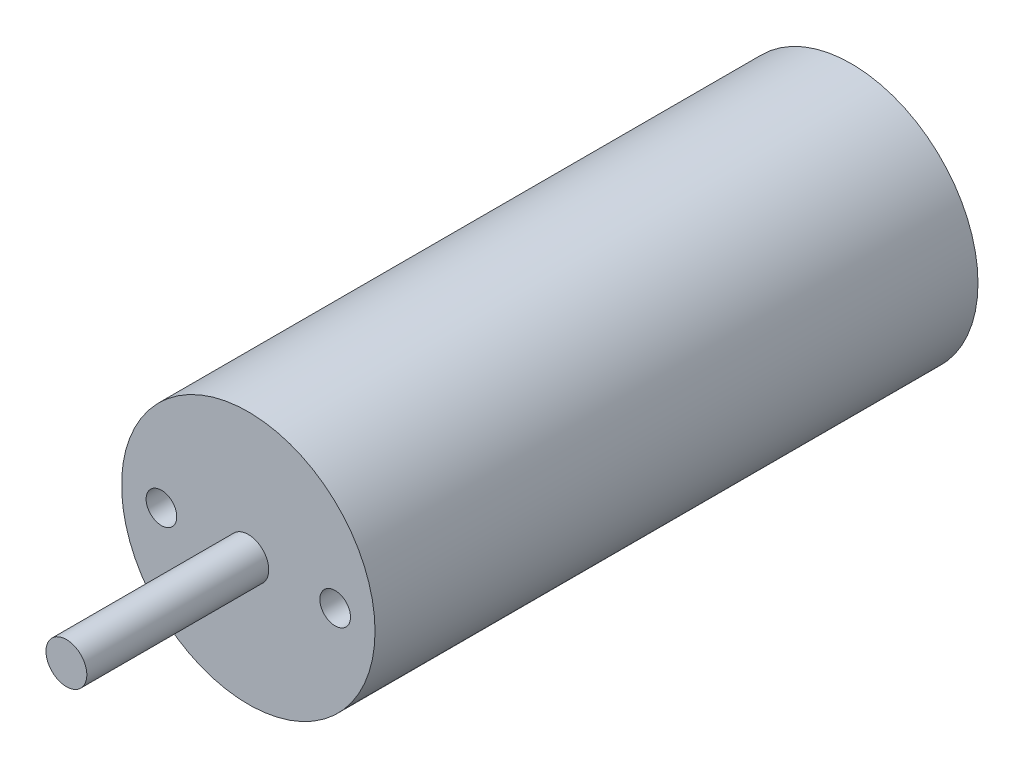
ISO-10303-21;
HEADER;
FILE_DESCRIPTION(('STEP AP214'),'2;1');
FILE_NAME('part.step','',(''),(''),'','','');
FILE_SCHEMA(('AUTOMOTIVE_DESIGN { 1 0 10303 214 1 1 1 1 }'));
ENDSEC;
DATA;
#1=APPLICATION_CONTEXT('core data for automotive mechanical design processes');
#2=APPLICATION_PROTOCOL_DEFINITION('international standard','automotive_design',2000,#1);
#3=PRODUCT_CONTEXT('',#1,'mechanical');
#4=PRODUCT('Part','Part','',(#3));
#5=PRODUCT_RELATED_PRODUCT_CATEGORY('part','',(#4));
#6=PRODUCT_DEFINITION_FORMATION('','',#4);
#7=PRODUCT_DEFINITION_CONTEXT('part definition',#1,'design');
#8=PRODUCT_DEFINITION('design','',#6,#7);
#9=PRODUCT_DEFINITION_SHAPE('','',#8);
#10=(LENGTH_UNIT() NAMED_UNIT(*) SI_UNIT(.MILLI.,.METRE.));
#11=(NAMED_UNIT(*) PLANE_ANGLE_UNIT() SI_UNIT($,.RADIAN.));
#12=(NAMED_UNIT(*) SI_UNIT($,.STERADIAN.) SOLID_ANGLE_UNIT());
#13=UNCERTAINTY_MEASURE_WITH_UNIT(LENGTH_MEASURE(1.E-05),#10,'distance_accuracy_value','');
#14=(GEOMETRIC_REPRESENTATION_CONTEXT(3) GLOBAL_UNCERTAINTY_ASSIGNED_CONTEXT((#13)) GLOBAL_UNIT_ASSIGNED_CONTEXT((#10,
#11,#12)) REPRESENTATION_CONTEXT('',''));
#15=CARTESIAN_POINT('',(0.,0.,0.));
#16=DIRECTION('',(0.,0.,1.));
#17=DIRECTION('',(1.,0.,0.));
#18=AXIS2_PLACEMENT_3D('',#15,#16,#17);
#19=CARTESIAN_POINT('',(12.4,0.,59.));
#20=DIRECTION('',(0.,0.,-1.));
#21=DIRECTION('',(-1.,0.,0.));
#22=AXIS2_PLACEMENT_3D('',#19,#20,#21);
#23=CYLINDRICAL_SURFACE('',#22,12.4);
#24=CARTESIAN_POINT('',(12.4,0.,59.));
#25=DIRECTION('',(0.,0.,1.));
#26=DIRECTION('',(1.,0.,0.));
#27=AXIS2_PLACEMENT_3D('',#24,#25,#26);
#28=CIRCLE('',#27,12.4);
#29=CARTESIAN_POINT('',(24.8,0.,59.));
#30=VERTEX_POINT('',#29);
#31=EDGE_CURVE('E43',#30,#30,#28,.T.);
#32=ORIENTED_EDGE('',*,*,#31,.F.);
#33=EDGE_LOOP('',(#32));
#34=FACE_BOUND('',#33,.T.);
#35=CARTESIAN_POINT('',(12.4,0.,0.));
#36=DIRECTION('',(0.,0.,1.));
#37=DIRECTION('',(1.,0.,0.));
#38=AXIS2_PLACEMENT_3D('',#35,#36,#37);
#39=CIRCLE('',#38,12.4);
#40=CARTESIAN_POINT('',(24.8,0.,0.));
#41=VERTEX_POINT('',#40);
#42=EDGE_CURVE('E39',#41,#41,#39,.T.);
#43=ORIENTED_EDGE('',*,*,#42,.T.);
#44=EDGE_LOOP('',(#43));
#45=FACE_BOUND('',#44,.T.);
#46=ADVANCED_FACE('F36',(#34,#45),#23,.T.);
#47=CARTESIAN_POINT('',(12.4,0.,59.));
#48=DIRECTION('',(0.,0.,1.));
#49=DIRECTION('',(1.,0.,0.));
#50=AXIS2_PLACEMENT_3D('',#47,#48,#49);
#51=PLANE('',#50);
#52=CARTESIAN_POINT('',(20.9,0.,59.));
#53=DIRECTION('',(0.,0.,1.));
#54=DIRECTION('',(1.,0.,0.));
#55=AXIS2_PLACEMENT_3D('',#52,#53,#54);
#56=CIRCLE('',#55,1.5);
#57=CARTESIAN_POINT('',(22.4,0.,59.));
#58=VERTEX_POINT('',#57);
#59=EDGE_CURVE('E59',#58,#58,#56,.T.);
#60=ORIENTED_EDGE('',*,*,#59,.F.);
#61=EDGE_LOOP('',(#60));
#62=FACE_BOUND('',#61,.T.);
#63=CARTESIAN_POINT('',(3.9,0.,59.));
#64=DIRECTION('',(0.,0.,1.));
#65=DIRECTION('',(-1.,0.,0.));
#66=AXIS2_PLACEMENT_3D('',#63,#64,#65);
#67=CIRCLE('',#66,1.5);
#68=CARTESIAN_POINT('',(2.4,0.,59.));
#69=VERTEX_POINT('',#68);
#70=EDGE_CURVE('E56',#69,#69,#67,.T.);
#71=ORIENTED_EDGE('',*,*,#70,.F.);
#72=EDGE_LOOP('',(#71));
#73=FACE_BOUND('',#72,.T.);
#74=CARTESIAN_POINT('',(12.4,0.,59.));
#75=DIRECTION('',(0.,0.,1.));
#76=DIRECTION('',(1.,0.,0.));
#77=AXIS2_PLACEMENT_3D('',#74,#75,#76);
#78=CIRCLE('',#77,2.);
#79=CARTESIAN_POINT('',(14.4,0.,59.));
#80=VERTEX_POINT('',#79);
#81=EDGE_CURVE('E10',#80,#80,#78,.T.);
#82=ORIENTED_EDGE('',*,*,#81,.F.);
#83=EDGE_LOOP('',(#82));
#84=FACE_BOUND('',#83,.T.);
#85=ORIENTED_EDGE('',*,*,#31,.T.);
#86=EDGE_LOOP('',(#85));
#87=FACE_BOUND('',#86,.T.);
#88=ADVANCED_FACE('F74',(#62,#73,#84,#87),#51,.T.);
#89=CARTESIAN_POINT('',(12.4,0.,0.));
#90=DIRECTION('',(0.,0.,1.));
#91=DIRECTION('',(1.,0.,0.));
#92=AXIS2_PLACEMENT_3D('',#89,#90,#91);
#93=PLANE('',#92);
#94=ORIENTED_EDGE('',*,*,#42,.F.);
#95=EDGE_LOOP('',(#94));
#96=FACE_BOUND('',#95,.T.);
#97=ADVANCED_FACE('F77',(#96),#93,.F.);
#98=CARTESIAN_POINT('',(12.4,0.,76.8));
#99=DIRECTION('',(0.,0.,-1.));
#100=DIRECTION('',(-1.,0.,0.));
#101=AXIS2_PLACEMENT_3D('',#98,#99,#100);
#102=CYLINDRICAL_SURFACE('',#101,2.);
#103=CARTESIAN_POINT('',(12.4,0.,76.8));
#104=DIRECTION('',(0.,0.,1.));
#105=DIRECTION('',(1.,0.,0.));
#106=AXIS2_PLACEMENT_3D('',#103,#104,#105);
#107=CIRCLE('',#106,2.);
#108=CARTESIAN_POINT('',(14.4,0.,76.8));
#109=VERTEX_POINT('',#108);
#110=EDGE_CURVE('E49',#109,#109,#107,.T.);
#111=ORIENTED_EDGE('',*,*,#110,.F.);
#112=EDGE_LOOP('',(#111));
#113=FACE_BOUND('',#112,.T.);
#114=ORIENTED_EDGE('',*,*,#81,.T.);
#115=EDGE_LOOP('',(#114));
#116=FACE_BOUND('',#115,.T.);
#117=ADVANCED_FACE('F90',(#113,#116),#102,.T.);
#118=CARTESIAN_POINT('',(12.4,0.,76.8));
#119=DIRECTION('',(0.,0.,1.));
#120=DIRECTION('',(1.,0.,0.));
#121=AXIS2_PLACEMENT_3D('',#118,#119,#120);
#122=PLANE('',#121);
#123=ORIENTED_EDGE('',*,*,#110,.T.);
#124=EDGE_LOOP('',(#123));
#125=FACE_BOUND('',#124,.T.);
#126=ADVANCED_FACE('F94',(#125),#122,.T.);
#127=CARTESIAN_POINT('',(3.9,0.,54.6058));
#128=DIRECTION('',(0.,0.,1.));
#129=DIRECTION('',(1.,0.,0.));
#130=AXIS2_PLACEMENT_3D('',#127,#128,#129);
#131=CYLINDRICAL_SURFACE('',#130,1.5);
#132=CARTESIAN_POINT('',(3.9,0.,54.6058));
#133=DIRECTION('',(0.,0.,1.));
#134=DIRECTION('',(-1.,0.,0.));
#135=AXIS2_PLACEMENT_3D('',#132,#133,#134);
#136=CIRCLE('',#135,1.5);
#137=CARTESIAN_POINT('',(2.4,0.,54.6058));
#138=VERTEX_POINT('',#137);
#139=EDGE_CURVE('E53',#138,#138,#136,.T.);
#140=ORIENTED_EDGE('',*,*,#139,.F.);
#141=EDGE_LOOP('',(#140));
#142=FACE_BOUND('',#141,.T.);
#143=ORIENTED_EDGE('',*,*,#70,.T.);
#144=EDGE_LOOP('',(#143));
#145=FACE_BOUND('',#144,.T.);
#146=ADVANCED_FACE('F100',(#142,#145),#131,.F.);
#147=CARTESIAN_POINT('',(3.9,0.,54.6058));
#148=DIRECTION('',(0.,0.,-1.));
#149=DIRECTION('',(-1.,0.,0.));
#150=AXIS2_PLACEMENT_3D('',#147,#148,#149);
#151=PLANE('',#150);
#152=ORIENTED_EDGE('',*,*,#139,.T.);
#153=EDGE_LOOP('',(#152));
#154=FACE_BOUND('',#153,.T.);
#155=ADVANCED_FACE('F70',(#154),#151,.F.);
#156=CARTESIAN_POINT('',(20.9,0.,54.6058));
#157=DIRECTION('',(0.,0.,1.));
#158=DIRECTION('',(1.,0.,0.));
#159=AXIS2_PLACEMENT_3D('',#156,#157,#158);
#160=CYLINDRICAL_SURFACE('',#159,1.5);
#161=CARTESIAN_POINT('',(20.9,0.,54.6058));
#162=DIRECTION('',(0.,0.,1.));
#163=DIRECTION('',(1.,0.,0.));
#164=AXIS2_PLACEMENT_3D('',#161,#162,#163);
#165=CIRCLE('',#164,1.5);
#166=CARTESIAN_POINT('',(22.4,0.,54.6058));
#167=VERTEX_POINT('',#166);
#168=EDGE_CURVE('E52',#167,#167,#165,.T.);
#169=ORIENTED_EDGE('',*,*,#168,.F.);
#170=EDGE_LOOP('',(#169));
#171=FACE_BOUND('',#170,.T.);
#172=ORIENTED_EDGE('',*,*,#59,.T.);
#173=EDGE_LOOP('',(#172));
#174=FACE_BOUND('',#173,.T.);
#175=ADVANCED_FACE('F67',(#171,#174),#160,.F.);
#176=CARTESIAN_POINT('',(20.9,0.,54.6058));
#177=DIRECTION('',(0.,0.,1.));
#178=DIRECTION('',(1.,0.,0.));
#179=AXIS2_PLACEMENT_3D('',#176,#177,#178);
#180=PLANE('',#179);
#181=ORIENTED_EDGE('',*,*,#168,.T.);
#182=EDGE_LOOP('',(#181));
#183=FACE_BOUND('',#182,.T.);
#184=ADVANCED_FACE('F65',(#183),#180,.T.);
#185=CLOSED_SHELL('',(#46,#88,#97,#117,#126,#146,#155,#175,#184));
#186=MANIFOLD_SOLID_BREP('B2',#185);
#187=ADVANCED_BREP_SHAPE_REPRESENTATION('',(#18,#186),#14);
#188=SHAPE_DEFINITION_REPRESENTATION(#9,#187);
ENDSEC;
END-ISO-10303-21;
